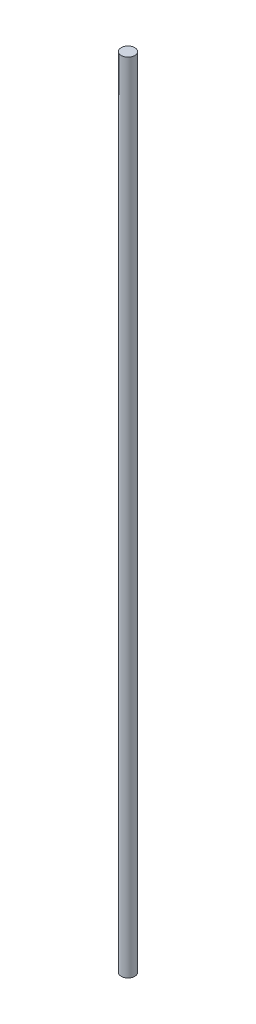
ISO-10303-21;
HEADER;
FILE_DESCRIPTION(('STEP AP214'),'2;1');
FILE_NAME('part.step','',(''),(''),'','','');
FILE_SCHEMA(('AUTOMOTIVE_DESIGN { 1 0 10303 214 1 1 1 1 }'));
ENDSEC;
DATA;
#1=APPLICATION_CONTEXT('core data for automotive mechanical design processes');
#2=APPLICATION_PROTOCOL_DEFINITION('international standard','automotive_design',2000,#1);
#3=PRODUCT_CONTEXT('',#1,'mechanical');
#4=PRODUCT('Part','Part','',(#3));
#5=PRODUCT_RELATED_PRODUCT_CATEGORY('part','',(#4));
#6=PRODUCT_DEFINITION_FORMATION('','',#4);
#7=PRODUCT_DEFINITION_CONTEXT('part definition',#1,'design');
#8=PRODUCT_DEFINITION('design','',#6,#7);
#9=PRODUCT_DEFINITION_SHAPE('','',#8);
#10=(LENGTH_UNIT() NAMED_UNIT(*) SI_UNIT(.MILLI.,.METRE.));
#11=(NAMED_UNIT(*) PLANE_ANGLE_UNIT() SI_UNIT($,.RADIAN.));
#12=(NAMED_UNIT(*) SI_UNIT($,.STERADIAN.) SOLID_ANGLE_UNIT());
#13=UNCERTAINTY_MEASURE_WITH_UNIT(LENGTH_MEASURE(1.E-05),#10,'distance_accuracy_value','');
#14=(GEOMETRIC_REPRESENTATION_CONTEXT(3) GLOBAL_UNCERTAINTY_ASSIGNED_CONTEXT((#13)) GLOBAL_UNIT_ASSIGNED_CONTEXT((#10,
#11,#12)) REPRESENTATION_CONTEXT('',''));
#15=CARTESIAN_POINT('',(0.,0.,0.));
#16=DIRECTION('',(0.,0.,1.));
#17=DIRECTION('',(1.,0.,0.));
#18=AXIS2_PLACEMENT_3D('',#15,#16,#17);
#19=CARTESIAN_POINT('',(0.,50.,0.));
#20=DIRECTION('',(0.,-1.,0.));
#21=DIRECTION('',(0.,0.,-1.));
#22=AXIS2_PLACEMENT_3D('',#19,#20,#21);
#23=CYLINDRICAL_SURFACE('',#22,0.855);
#24=CARTESIAN_POINT('',(0.,50.,0.));
#25=DIRECTION('',(0.,1.,0.));
#26=DIRECTION('',(0.,0.,1.));
#27=AXIS2_PLACEMENT_3D('',#24,#25,#26);
#28=CIRCLE('',#27,0.855);
#29=CARTESIAN_POINT('',(0.,50.,0.855));
#30=VERTEX_POINT('',#29);
#31=EDGE_CURVE('E10',#30,#30,#28,.T.);
#32=ORIENTED_EDGE('',*,*,#31,.F.);
#33=EDGE_LOOP('',(#32));
#34=FACE_BOUND('',#33,.T.);
#35=CARTESIAN_POINT('',(0.,-50.,0.));
#36=DIRECTION('',(0.,1.,0.));
#37=DIRECTION('',(0.,0.,1.));
#38=AXIS2_PLACEMENT_3D('',#35,#36,#37);
#39=CIRCLE('',#38,0.855);
#40=CARTESIAN_POINT('',(0.,-50.,0.855));
#41=VERTEX_POINT('',#40);
#42=EDGE_CURVE('E36',#41,#41,#39,.T.);
#43=ORIENTED_EDGE('',*,*,#42,.T.);
#44=EDGE_LOOP('',(#43));
#45=FACE_BOUND('',#44,.T.);
#46=ADVANCED_FACE('F33',(#34,#45),#23,.T.);
#47=CARTESIAN_POINT('',(0.,50.,0.));
#48=DIRECTION('',(0.,1.,0.));
#49=DIRECTION('',(0.,0.,1.));
#50=AXIS2_PLACEMENT_3D('',#47,#48,#49);
#51=PLANE('',#50);
#52=ORIENTED_EDGE('',*,*,#31,.T.);
#53=EDGE_LOOP('',(#52));
#54=FACE_BOUND('',#53,.T.);
#55=ADVANCED_FACE('F48',(#54),#51,.T.);
#56=CARTESIAN_POINT('',(0.,-50.,0.));
#57=DIRECTION('',(0.,1.,0.));
#58=DIRECTION('',(0.,0.,1.));
#59=AXIS2_PLACEMENT_3D('',#56,#57,#58);
#60=PLANE('',#59);
#61=ORIENTED_EDGE('',*,*,#42,.F.);
#62=EDGE_LOOP('',(#61));
#63=FACE_BOUND('',#62,.T.);
#64=ADVANCED_FACE('F46',(#63),#60,.F.);
#65=CLOSED_SHELL('',(#46,#55,#64));
#66=MANIFOLD_SOLID_BREP('B2',#65);
#67=ADVANCED_BREP_SHAPE_REPRESENTATION('',(#18,#66),#14);
#68=SHAPE_DEFINITION_REPRESENTATION(#9,#67);
ENDSEC;
END-ISO-10303-21;
